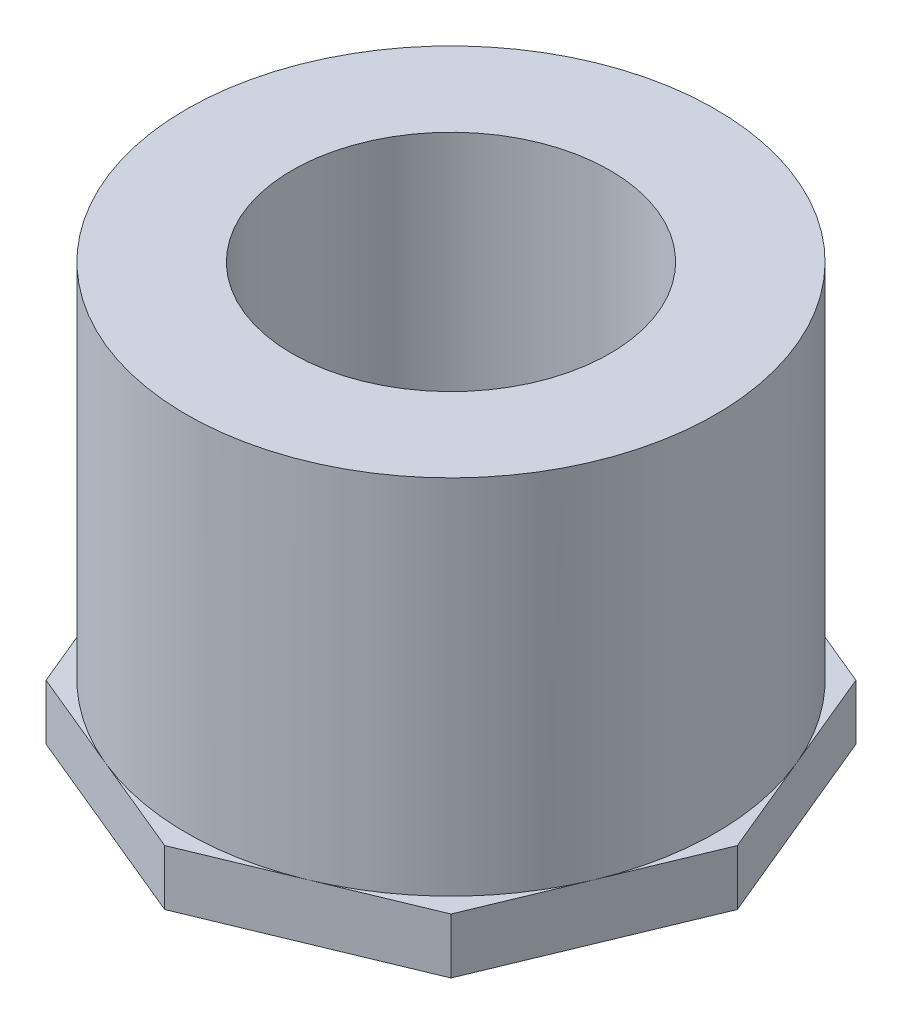
ISO-10303-21;
HEADER;
FILE_DESCRIPTION(('STEP AP214'),'2;1');
FILE_NAME('part.step','',(''),(''),'','','');
FILE_SCHEMA(('AUTOMOTIVE_DESIGN { 1 0 10303 214 1 1 1 1 }'));
ENDSEC;
DATA;
#1=APPLICATION_CONTEXT('core data for automotive mechanical design processes');
#2=APPLICATION_PROTOCOL_DEFINITION('international standard','automotive_design',2000,#1);
#3=PRODUCT_CONTEXT('',#1,'mechanical');
#4=PRODUCT('Part','Part','',(#3));
#5=PRODUCT_RELATED_PRODUCT_CATEGORY('part','',(#4));
#6=PRODUCT_DEFINITION_FORMATION('','',#4);
#7=PRODUCT_DEFINITION_CONTEXT('part definition',#1,'design');
#8=PRODUCT_DEFINITION('design','',#6,#7);
#9=PRODUCT_DEFINITION_SHAPE('','',#8);
#10=(LENGTH_UNIT() NAMED_UNIT(*) SI_UNIT(.MILLI.,.METRE.));
#11=(NAMED_UNIT(*) PLANE_ANGLE_UNIT() SI_UNIT($,.RADIAN.));
#12=(NAMED_UNIT(*) SI_UNIT($,.STERADIAN.) SOLID_ANGLE_UNIT());
#13=UNCERTAINTY_MEASURE_WITH_UNIT(LENGTH_MEASURE(1.E-05),#10,'distance_accuracy_value','');
#14=(GEOMETRIC_REPRESENTATION_CONTEXT(3) GLOBAL_UNCERTAINTY_ASSIGNED_CONTEXT((#13)) GLOBAL_UNIT_ASSIGNED_CONTEXT((#10,
#11,#12)) REPRESENTATION_CONTEXT('',''));
#15=CARTESIAN_POINT('',(0.,0.,0.));
#16=DIRECTION('',(0.,0.,1.));
#17=DIRECTION('',(1.,0.,0.));
#18=AXIS2_PLACEMENT_3D('',#15,#16,#17);
#19=CARTESIAN_POINT('',(0.,0.,0.));
#20=DIRECTION('',(0.,1.,0.));
#21=DIRECTION('',(-1.,0.,0.));
#22=AXIS2_PLACEMENT_3D('',#19,#20,#21);
#23=CYLINDRICAL_SURFACE('',#22,24.13);
#24=CARTESIAN_POINT('',(0.,38.1,0.));
#25=DIRECTION('',(0.,1.,0.));
#26=DIRECTION('',(-1.,0.,0.));
#27=AXIS2_PLACEMENT_3D('',#24,#25,#26);
#28=CIRCLE('',#27,24.13);
#29=CARTESIAN_POINT('',(-24.13,38.1,0.));
#30=VERTEX_POINT('',#29);
#31=EDGE_CURVE('E259',#30,#30,#28,.T.);
#32=ORIENTED_EDGE('',*,*,#31,.F.);
#33=EDGE_LOOP('',(#32));
#34=FACE_BOUND('',#33,.T.);
#35=CARTESIAN_POINT('',(0.,5.0546,0.));
#36=DIRECTION('',(0.,-1.,0.));
#37=DIRECTION('',(1.,0.,0.));
#38=AXIS2_PLACEMENT_3D('',#35,#36,#37);
#39=CIRCLE('',#38,24.13);
#40=CARTESIAN_POINT('',(22.2932131194974,5.0546,9.23415122296961));
#41=VERTEX_POINT('',#40);
#42=CARTESIAN_POINT('',(22.2932131194973,5.0546,-9.23415122296962));
#43=VERTEX_POINT('',#42);
#44=EDGE_CURVE('E53',#41,#43,#39,.F.);
#45=ORIENTED_EDGE('',*,*,#44,.T.);
#46=CARTESIAN_POINT('',(9.23415122296961,5.0546,-22.2932131194974));
#47=VERTEX_POINT('',#46);
#48=EDGE_CURVE('E11',#43,#47,#39,.F.);
#49=ORIENTED_EDGE('',*,*,#48,.T.);
#50=CARTESIAN_POINT('',(-9.23415122296962,5.0546,-22.2932131194973));
#51=VERTEX_POINT('',#50);
#52=EDGE_CURVE('E59',#47,#51,#39,.F.);
#53=ORIENTED_EDGE('',*,*,#52,.T.);
#54=CARTESIAN_POINT('',(-22.2932131194973,5.0546,-9.23415122296961));
#55=VERTEX_POINT('',#54);
#56=EDGE_CURVE('E299',#51,#55,#39,.F.);
#57=ORIENTED_EDGE('',*,*,#56,.T.);
#58=CARTESIAN_POINT('',(-22.2932131194973,5.0546,9.23415122296961));
#59=VERTEX_POINT('',#58);
#60=EDGE_CURVE('E296',#55,#59,#39,.F.);
#61=ORIENTED_EDGE('',*,*,#60,.T.);
#62=CARTESIAN_POINT('',(-9.23415122296961,5.0546,22.2932131194973));
#63=VERTEX_POINT('',#62);
#64=EDGE_CURVE('E294',#59,#63,#39,.F.);
#65=ORIENTED_EDGE('',*,*,#64,.T.);
#66=CARTESIAN_POINT('',(9.23415122296962,5.0546,22.2932131194973));
#67=VERTEX_POINT('',#66);
#68=EDGE_CURVE('E80',#63,#67,#39,.F.);
#69=ORIENTED_EDGE('',*,*,#68,.T.);
#70=EDGE_CURVE('E288',#67,#41,#39,.F.);
#71=ORIENTED_EDGE('',*,*,#70,.T.);
#72=EDGE_LOOP('',(#45,#49,#53,#57,#61,#65,#69,#71));
#73=FACE_BOUND('',#72,.T.);
#74=ADVANCED_FACE('F49',(#34,#73),#23,.T.);
#75=CARTESIAN_POINT('',(-24.13,0.,0.));
#76=DIRECTION('',(0.,-1.,0.));
#77=DIRECTION('',(1.,0.,0.));
#78=AXIS2_PLACEMENT_3D('',#75,#76,#77);
#79=PLANE('',#78);
#80=CARTESIAN_POINT('',(0.,0.,0.));
#81=DIRECTION('',(0.,-1.,0.));
#82=DIRECTION('',(0.,0.,-1.));
#83=AXIS2_PLACEMENT_3D('',#80,#81,#82);
#84=CIRCLE('',#83,15.730601);
#85=CARTESIAN_POINT('',(0.,0.,-15.730601));
#86=VERTEX_POINT('',#85);
#87=EDGE_CURVE('E367',#86,#86,#84,.T.);
#88=ORIENTED_EDGE('',*,*,#87,.F.);
#89=EDGE_LOOP('',(#88));
#90=FACE_BOUND('',#89,.T.);
#91=DIRECTION('',(-0.923879532511287,0.,0.38268343236509));
#92=VECTOR('',#91,1.);
#93=CARTESIAN_POINT('',(18.4683024459393,0.,18.4683024459392));
#94=LINE('',#93,#92);
#95=CARTESIAN_POINT('',(18.4683024459393,0.,18.4683024459392));
#96=VERTEX_POINT('',#95);
#97=CARTESIAN_POINT('',(0.,0.,26.1181237930555));
#98=VERTEX_POINT('',#97);
#99=EDGE_CURVE('E227',#96,#98,#94,.T.);
#100=ORIENTED_EDGE('',*,*,#99,.T.);
#101=DIRECTION('',(-0.923879532511287,0.,-0.382683432365089));
#102=VECTOR('',#101,1.);
#103=CARTESIAN_POINT('',(0.,0.,26.1181237930555));
#104=LINE('',#103,#102);
#105=CARTESIAN_POINT('',(-18.4683024459392,0.,18.4683024459392));
#106=VERTEX_POINT('',#105);
#107=EDGE_CURVE('E184',#98,#106,#104,.T.);
#108=ORIENTED_EDGE('',*,*,#107,.T.);
#109=DIRECTION('',(-0.38268343236509,0.,-0.923879532511287));
#110=VECTOR('',#109,1.);
#111=CARTESIAN_POINT('',(-18.4683024459392,0.,18.4683024459392));
#112=LINE('',#111,#110);
#113=CARTESIAN_POINT('',(-26.1181237930555,0.,0.));
#114=VERTEX_POINT('',#113);
#115=EDGE_CURVE('E233',#106,#114,#112,.T.);
#116=ORIENTED_EDGE('',*,*,#115,.T.);
#117=DIRECTION('',(0.38268343236509,0.,-0.923879532511287));
#118=VECTOR('',#117,1.);
#119=CARTESIAN_POINT('',(-26.1181237930555,0.,0.));
#120=LINE('',#119,#118);
#121=CARTESIAN_POINT('',(-18.4683024459392,0.,-18.4683024459392));
#122=VERTEX_POINT('',#121);
#123=EDGE_CURVE('E237',#114,#122,#120,.T.);
#124=ORIENTED_EDGE('',*,*,#123,.T.);
#125=DIRECTION('',(0.923879532511287,0.,-0.38268343236509));
#126=VECTOR('',#125,1.);
#127=CARTESIAN_POINT('',(-18.4683024459392,0.,-18.4683024459392));
#128=LINE('',#127,#126);
#129=CARTESIAN_POINT('',(0.,0.,-26.1181237930555));
#130=VERTEX_POINT('',#129);
#131=EDGE_CURVE('E241',#122,#130,#128,.T.);
#132=ORIENTED_EDGE('',*,*,#131,.T.);
#133=DIRECTION('',(0.923879532511287,0.,0.38268343236509));
#134=VECTOR('',#133,1.);
#135=CARTESIAN_POINT('',(0.,0.,-26.1181237930555));
#136=LINE('',#135,#134);
#137=CARTESIAN_POINT('',(18.4683024459392,0.,-18.4683024459392));
#138=VERTEX_POINT('',#137);
#139=EDGE_CURVE('E245',#130,#138,#136,.T.);
#140=ORIENTED_EDGE('',*,*,#139,.T.);
#141=DIRECTION('',(0.38268343236509,0.,0.923879532511287));
#142=VECTOR('',#141,1.);
#143=CARTESIAN_POINT('',(18.4683024459392,0.,-18.4683024459392));
#144=LINE('',#143,#142);
#145=CARTESIAN_POINT('',(26.1181237930555,0.,0.));
#146=VERTEX_POINT('',#145);
#147=EDGE_CURVE('E248',#138,#146,#144,.T.);
#148=ORIENTED_EDGE('',*,*,#147,.T.);
#149=DIRECTION('',(-0.382683432365089,0.,0.923879532511287));
#150=VECTOR('',#149,1.);
#151=CARTESIAN_POINT('',(26.1181237930555,0.,0.));
#152=LINE('',#151,#150);
#153=EDGE_CURVE('E175',#146,#96,#152,.T.);
#154=ORIENTED_EDGE('',*,*,#153,.T.);
#155=EDGE_LOOP('',(#100,#108,#116,#124,#132,#140,#148,#154));
#156=FACE_BOUND('',#155,.T.);
#157=ADVANCED_FACE('F51',(#90,#156),#79,.T.);
#158=CARTESIAN_POINT('',(-6.35,38.1,0.));
#159=DIRECTION('',(0.,1.,0.));
#160=DIRECTION('',(-1.,0.,0.));
#161=AXIS2_PLACEMENT_3D('',#158,#159,#160);
#162=PLANE('',#161);
#163=CARTESIAN_POINT('',(0.,38.1,0.));
#164=DIRECTION('',(0.,-1.,0.));
#165=DIRECTION('',(0.,0.,-1.));
#166=AXIS2_PLACEMENT_3D('',#163,#164,#165);
#167=CIRCLE('',#166,14.4907);
#168=CARTESIAN_POINT('',(0.,38.1,-14.4907));
#169=VERTEX_POINT('',#168);
#170=EDGE_CURVE('E230',#169,#169,#167,.T.);
#171=ORIENTED_EDGE('',*,*,#170,.T.);
#172=EDGE_LOOP('',(#171));
#173=FACE_BOUND('',#172,.T.);
#174=ORIENTED_EDGE('',*,*,#31,.T.);
#175=EDGE_LOOP('',(#174));
#176=FACE_BOUND('',#175,.T.);
#177=ADVANCED_FACE('F347',(#173,#176),#162,.T.);
#178=CARTESIAN_POINT('',(18.4683024459393,5.0546,18.4683024459392));
#179=DIRECTION('',(0.38268343236509,0.,0.923879532511287));
#180=DIRECTION('',(0.923879532511287,0.,-0.38268343236509));
#181=AXIS2_PLACEMENT_3D('',#178,#179,#180);
#182=PLANE('',#181);
#183=ORIENTED_EDGE('',*,*,#99,.F.);
#184=DIRECTION('',(0.,-1.,0.));
#185=VECTOR('',#184,1.);
#186=CARTESIAN_POINT('',(18.4683024459393,5.0546,18.4683024459392));
#187=LINE('',#186,#185);
#188=CARTESIAN_POINT('',(18.4683024459393,5.0546,18.4683024459392));
#189=VERTEX_POINT('',#188);
#190=EDGE_CURVE('E255',#189,#96,#187,.T.);
#191=ORIENTED_EDGE('',*,*,#190,.F.);
#192=DIRECTION('',(-0.923879532511287,0.,0.38268343236509));
#193=VECTOR('',#192,1.);
#194=CARTESIAN_POINT('',(18.4683024459393,5.0546,18.4683024459392));
#195=LINE('',#194,#193);
#196=EDGE_CURVE('E173',#189,#67,#195,.T.);
#197=ORIENTED_EDGE('',*,*,#196,.T.);
#198=CARTESIAN_POINT('',(0.,5.0546,26.1181237930555));
#199=VERTEX_POINT('',#198);
#200=EDGE_CURVE('E167',#67,#199,#195,.T.);
#201=ORIENTED_EDGE('',*,*,#200,.T.);
#202=DIRECTION('',(0.,-1.,0.));
#203=VECTOR('',#202,1.);
#204=CARTESIAN_POINT('',(0.,5.0546,26.1181237930555));
#205=LINE('',#204,#203);
#206=EDGE_CURVE('E170',#199,#98,#205,.T.);
#207=ORIENTED_EDGE('',*,*,#206,.T.);
#208=EDGE_LOOP('',(#183,#191,#197,#201,#207));
#209=FACE_BOUND('',#208,.T.);
#210=ADVANCED_FACE('F169',(#209),#182,.T.);
#211=CARTESIAN_POINT('',(26.1181237930555,5.0546,0.));
#212=DIRECTION('',(0.923879532511287,0.,0.38268343236509));
#213=DIRECTION('',(0.38268343236509,0.,-0.923879532511287));
#214=AXIS2_PLACEMENT_3D('',#211,#212,#213);
#215=PLANE('',#214);
#216=ORIENTED_EDGE('',*,*,#153,.F.);
#217=DIRECTION('',(0.,-1.,0.));
#218=VECTOR('',#217,1.);
#219=CARTESIAN_POINT('',(26.1181237930555,5.0546,0.));
#220=LINE('',#219,#218);
#221=CARTESIAN_POINT('',(26.1181237930555,5.0546,0.));
#222=VERTEX_POINT('',#221);
#223=EDGE_CURVE('E260',#222,#146,#220,.T.);
#224=ORIENTED_EDGE('',*,*,#223,.F.);
#225=DIRECTION('',(-0.382683432365089,0.,0.923879532511287));
#226=VECTOR('',#225,1.);
#227=CARTESIAN_POINT('',(26.1181237930555,5.0546,0.));
#228=LINE('',#227,#226);
#229=EDGE_CURVE('E188',#222,#41,#228,.T.);
#230=ORIENTED_EDGE('',*,*,#229,.T.);
#231=EDGE_CURVE('E223',#41,#189,#228,.T.);
#232=ORIENTED_EDGE('',*,*,#231,.T.);
#233=ORIENTED_EDGE('',*,*,#190,.T.);
#234=EDGE_LOOP('',(#216,#224,#230,#232,#233));
#235=FACE_BOUND('',#234,.T.);
#236=ADVANCED_FACE('F356',(#235),#215,.T.);
#237=CARTESIAN_POINT('',(18.4683024459392,5.0546,-18.4683024459392));
#238=DIRECTION('',(0.923879532511287,0.,-0.38268343236509));
#239=DIRECTION('',(-0.38268343236509,0.,-0.923879532511287));
#240=AXIS2_PLACEMENT_3D('',#237,#238,#239);
#241=PLANE('',#240);
#242=ORIENTED_EDGE('',*,*,#223,.T.);
#243=ORIENTED_EDGE('',*,*,#147,.F.);
#244=DIRECTION('',(0.,-1.,0.));
#245=VECTOR('',#244,1.);
#246=CARTESIAN_POINT('',(18.4683024459392,5.0546,-18.4683024459392));
#247=LINE('',#246,#245);
#248=CARTESIAN_POINT('',(18.4683024459392,5.0546,-18.4683024459392));
#249=VERTEX_POINT('',#248);
#250=EDGE_CURVE('E264',#249,#138,#247,.T.);
#251=ORIENTED_EDGE('',*,*,#250,.F.);
#252=DIRECTION('',(0.38268343236509,0.,0.923879532511287));
#253=VECTOR('',#252,1.);
#254=CARTESIAN_POINT('',(18.4683024459392,5.0546,-18.4683024459392));
#255=LINE('',#254,#253);
#256=EDGE_CURVE('E69',#249,#43,#255,.T.);
#257=ORIENTED_EDGE('',*,*,#256,.T.);
#258=EDGE_CURVE('E220',#43,#222,#255,.T.);
#259=ORIENTED_EDGE('',*,*,#258,.T.);
#260=EDGE_LOOP('',(#242,#243,#251,#257,#259));
#261=FACE_BOUND('',#260,.T.);
#262=ADVANCED_FACE('F383',(#261),#241,.T.);
#263=CARTESIAN_POINT('',(0.,5.0546,-26.1181237930555));
#264=DIRECTION('',(0.382683432365089,0.,-0.923879532511287));
#265=DIRECTION('',(-0.923879532511287,0.,-0.38268343236509));
#266=AXIS2_PLACEMENT_3D('',#263,#264,#265);
#267=PLANE('',#266);
#268=ORIENTED_EDGE('',*,*,#139,.F.);
#269=DIRECTION('',(0.,-1.,0.));
#270=VECTOR('',#269,1.);
#271=CARTESIAN_POINT('',(0.,5.0546,-26.1181237930555));
#272=LINE('',#271,#270);
#273=CARTESIAN_POINT('',(0.,5.0546,-26.1181237930555));
#274=VERTEX_POINT('',#273);
#275=EDGE_CURVE('E268',#274,#130,#272,.T.);
#276=ORIENTED_EDGE('',*,*,#275,.F.);
#277=DIRECTION('',(0.923879532511287,0.,0.38268343236509));
#278=VECTOR('',#277,1.);
#279=CARTESIAN_POINT('',(0.,5.0546,-26.1181237930555));
#280=LINE('',#279,#278);
#281=EDGE_CURVE('E216',#274,#47,#280,.T.);
#282=ORIENTED_EDGE('',*,*,#281,.T.);
#283=EDGE_CURVE('E215',#47,#249,#280,.T.);
#284=ORIENTED_EDGE('',*,*,#283,.T.);
#285=ORIENTED_EDGE('',*,*,#250,.T.);
#286=EDGE_LOOP('',(#268,#276,#282,#284,#285));
#287=FACE_BOUND('',#286,.T.);
#288=ADVANCED_FACE('F316',(#287),#267,.T.);
#289=CARTESIAN_POINT('',(-18.4683024459392,5.0546,-18.4683024459392));
#290=DIRECTION('',(-0.38268343236509,0.,-0.923879532511287));
#291=DIRECTION('',(-0.923879532511287,0.,0.38268343236509));
#292=AXIS2_PLACEMENT_3D('',#289,#290,#291);
#293=PLANE('',#292);
#294=ORIENTED_EDGE('',*,*,#131,.F.);
#295=DIRECTION('',(0.,-1.,0.));
#296=VECTOR('',#295,1.);
#297=CARTESIAN_POINT('',(-18.4683024459392,5.0546,-18.4683024459392));
#298=LINE('',#297,#296);
#299=CARTESIAN_POINT('',(-18.4683024459392,5.0546,-18.4683024459392));
#300=VERTEX_POINT('',#299);
#301=EDGE_CURVE('E272',#300,#122,#298,.T.);
#302=ORIENTED_EDGE('',*,*,#301,.F.);
#303=DIRECTION('',(0.923879532511287,0.,-0.38268343236509));
#304=VECTOR('',#303,1.);
#305=CARTESIAN_POINT('',(-18.4683024459392,5.0546,-18.4683024459392));
#306=LINE('',#305,#304);
#307=EDGE_CURVE('E211',#300,#51,#306,.T.);
#308=ORIENTED_EDGE('',*,*,#307,.T.);
#309=EDGE_CURVE('E210',#51,#274,#306,.T.);
#310=ORIENTED_EDGE('',*,*,#309,.T.);
#311=ORIENTED_EDGE('',*,*,#275,.T.);
#312=EDGE_LOOP('',(#294,#302,#308,#310,#311));
#313=FACE_BOUND('',#312,.T.);
#314=ADVANCED_FACE('F318',(#313),#293,.T.);
#315=CARTESIAN_POINT('',(-26.1181237930555,5.0546,0.));
#316=DIRECTION('',(-0.923879532511287,0.,-0.38268343236509));
#317=DIRECTION('',(-0.38268343236509,0.,0.923879532511287));
#318=AXIS2_PLACEMENT_3D('',#315,#316,#317);
#319=PLANE('',#318);
#320=ORIENTED_EDGE('',*,*,#123,.F.);
#321=DIRECTION('',(0.,-1.,0.));
#322=VECTOR('',#321,1.);
#323=CARTESIAN_POINT('',(-26.1181237930555,5.0546,0.));
#324=LINE('',#323,#322);
#325=CARTESIAN_POINT('',(-26.1181237930555,5.0546,0.));
#326=VERTEX_POINT('',#325);
#327=EDGE_CURVE('E276',#326,#114,#324,.T.);
#328=ORIENTED_EDGE('',*,*,#327,.F.);
#329=DIRECTION('',(0.38268343236509,0.,-0.923879532511287));
#330=VECTOR('',#329,1.);
#331=CARTESIAN_POINT('',(-26.1181237930555,5.0546,0.));
#332=LINE('',#331,#330);
#333=EDGE_CURVE('E206',#326,#55,#332,.T.);
#334=ORIENTED_EDGE('',*,*,#333,.T.);
#335=EDGE_CURVE('E205',#55,#300,#332,.T.);
#336=ORIENTED_EDGE('',*,*,#335,.T.);
#337=ORIENTED_EDGE('',*,*,#301,.T.);
#338=EDGE_LOOP('',(#320,#328,#334,#336,#337));
#339=FACE_BOUND('',#338,.T.);
#340=ADVANCED_FACE('F324',(#339),#319,.T.);
#341=CARTESIAN_POINT('',(-18.4683024459392,5.0546,18.4683024459392));
#342=DIRECTION('',(-0.923879532511287,0.,0.38268343236509));
#343=DIRECTION('',(0.38268343236509,0.,0.923879532511287));
#344=AXIS2_PLACEMENT_3D('',#341,#342,#343);
#345=PLANE('',#344);
#346=ORIENTED_EDGE('',*,*,#115,.F.);
#347=DIRECTION('',(0.,-1.,0.));
#348=VECTOR('',#347,1.);
#349=CARTESIAN_POINT('',(-18.4683024459392,5.0546,18.4683024459392));
#350=LINE('',#349,#348);
#351=CARTESIAN_POINT('',(-18.4683024459392,5.0546,18.4683024459392));
#352=VERTEX_POINT('',#351);
#353=EDGE_CURVE('E187',#352,#106,#350,.T.);
#354=ORIENTED_EDGE('',*,*,#353,.F.);
#355=DIRECTION('',(-0.38268343236509,0.,-0.923879532511287));
#356=VECTOR('',#355,1.);
#357=CARTESIAN_POINT('',(-18.4683024459392,5.0546,18.4683024459392));
#358=LINE('',#357,#356);
#359=EDGE_CURVE('E198',#352,#59,#358,.T.);
#360=ORIENTED_EDGE('',*,*,#359,.T.);
#361=EDGE_CURVE('E192',#59,#326,#358,.T.);
#362=ORIENTED_EDGE('',*,*,#361,.T.);
#363=ORIENTED_EDGE('',*,*,#327,.T.);
#364=EDGE_LOOP('',(#346,#354,#360,#362,#363));
#365=FACE_BOUND('',#364,.T.);
#366=ADVANCED_FACE('F389',(#365),#345,.T.);
#367=CARTESIAN_POINT('',(0.,5.0546,26.1181237930555));
#368=DIRECTION('',(-0.382683432365089,0.,0.923879532511287));
#369=DIRECTION('',(0.923879532511287,0.,0.38268343236509));
#370=AXIS2_PLACEMENT_3D('',#367,#368,#369);
#371=PLANE('',#370);
#372=ORIENTED_EDGE('',*,*,#107,.F.);
#373=ORIENTED_EDGE('',*,*,#206,.F.);
#374=DIRECTION('',(-0.923879532511287,0.,-0.382683432365089));
#375=VECTOR('',#374,1.);
#376=CARTESIAN_POINT('',(0.,5.0546,26.1181237930555));
#377=LINE('',#376,#375);
#378=EDGE_CURVE('E180',#199,#63,#377,.T.);
#379=ORIENTED_EDGE('',*,*,#378,.T.);
#380=EDGE_CURVE('E193',#63,#352,#377,.T.);
#381=ORIENTED_EDGE('',*,*,#380,.T.);
#382=ORIENTED_EDGE('',*,*,#353,.T.);
#383=EDGE_LOOP('',(#372,#373,#379,#381,#382));
#384=FACE_BOUND('',#383,.T.);
#385=ADVANCED_FACE('F179',(#384),#371,.T.);
#386=CARTESIAN_POINT('',(0.,5.0546,0.));
#387=DIRECTION('',(0.,-1.,0.));
#388=DIRECTION('',(1.,0.,0.));
#389=AXIS2_PLACEMENT_3D('',#386,#387,#388);
#390=PLANE('',#389);
#391=ORIENTED_EDGE('',*,*,#48,.F.);
#392=ORIENTED_EDGE('',*,*,#256,.F.);
#393=ORIENTED_EDGE('',*,*,#283,.F.);
#394=EDGE_LOOP('',(#391,#392,#393));
#395=FACE_BOUND('',#394,.T.);
#396=ADVANCED_FACE('F312',(#395),#390,.F.);
#397=ORIENTED_EDGE('',*,*,#52,.F.);
#398=ORIENTED_EDGE('',*,*,#281,.F.);
#399=ORIENTED_EDGE('',*,*,#309,.F.);
#400=EDGE_LOOP('',(#397,#398,#399));
#401=FACE_BOUND('',#400,.T.);
#402=ADVANCED_FACE('F310',(#401),#390,.F.);
#403=ORIENTED_EDGE('',*,*,#56,.F.);
#404=ORIENTED_EDGE('',*,*,#307,.F.);
#405=ORIENTED_EDGE('',*,*,#335,.F.);
#406=EDGE_LOOP('',(#403,#404,#405));
#407=FACE_BOUND('',#406,.T.);
#408=ADVANCED_FACE('F328',(#407),#390,.F.);
#409=ORIENTED_EDGE('',*,*,#60,.F.);
#410=ORIENTED_EDGE('',*,*,#333,.F.);
#411=ORIENTED_EDGE('',*,*,#361,.F.);
#412=EDGE_LOOP('',(#409,#410,#411));
#413=FACE_BOUND('',#412,.T.);
#414=ADVANCED_FACE('F330',(#413),#390,.F.);
#415=ORIENTED_EDGE('',*,*,#64,.F.);
#416=ORIENTED_EDGE('',*,*,#359,.F.);
#417=ORIENTED_EDGE('',*,*,#380,.F.);
#418=EDGE_LOOP('',(#415,#416,#417));
#419=FACE_BOUND('',#418,.T.);
#420=ADVANCED_FACE('F336',(#419),#390,.F.);
#421=ORIENTED_EDGE('',*,*,#68,.F.);
#422=ORIENTED_EDGE('',*,*,#378,.F.);
#423=ORIENTED_EDGE('',*,*,#200,.F.);
#424=EDGE_LOOP('',(#421,#422,#423));
#425=FACE_BOUND('',#424,.T.);
#426=ADVANCED_FACE('F190',(#425),#390,.F.);
#427=ORIENTED_EDGE('',*,*,#70,.F.);
#428=ORIENTED_EDGE('',*,*,#196,.F.);
#429=ORIENTED_EDGE('',*,*,#231,.F.);
#430=EDGE_LOOP('',(#427,#428,#429));
#431=FACE_BOUND('',#430,.T.);
#432=ADVANCED_FACE('F377',(#431),#390,.F.);
#433=ORIENTED_EDGE('',*,*,#44,.F.);
#434=ORIENTED_EDGE('',*,*,#229,.F.);
#435=ORIENTED_EDGE('',*,*,#258,.F.);
#436=EDGE_LOOP('',(#433,#434,#435));
#437=FACE_BOUND('',#436,.T.);
#438=ADVANCED_FACE('F338',(#437),#390,.F.);
#439=CARTESIAN_POINT('',(0.,0.,0.));
#440=DIRECTION('',(0.,-1.,0.));
#441=DIRECTION('',(0.,0.,-1.));
#442=AXIS2_PLACEMENT_3D('',#439,#440,#441);
#443=CYLINDRICAL_SURFACE('',#442,14.4907);
#444=ORIENTED_EDGE('',*,*,#170,.F.);
#445=EDGE_LOOP('',(#444));
#446=FACE_BOUND('',#445,.T.);
#447=CARTESIAN_POINT('',(0.,16.78686,0.));
#448=DIRECTION('',(0.,-1.,0.));
#449=DIRECTION('',(0.,0.,-1.));
#450=AXIS2_PLACEMENT_3D('',#447,#448,#449);
#451=CIRCLE('',#450,14.4907);
#452=CARTESIAN_POINT('',(0.,16.78686,-14.4907));
#453=VERTEX_POINT('',#452);
#454=EDGE_CURVE('E360',#453,#453,#451,.T.);
#455=ORIENTED_EDGE('',*,*,#454,.T.);
#456=EDGE_LOOP('',(#455));
#457=FACE_BOUND('',#456,.T.);
#458=ADVANCED_FACE('F401',(#446,#457),#443,.F.);
#459=CARTESIAN_POINT('',(14.4907,16.78686,0.));
#460=DIRECTION('',(0.,1.,0.));
#461=DIRECTION('',(0.,0.,1.));
#462=AXIS2_PLACEMENT_3D('',#459,#460,#461);
#463=PLANE('',#462);
#464=ORIENTED_EDGE('',*,*,#454,.F.);
#465=EDGE_LOOP('',(#464));
#466=FACE_BOUND('',#465,.T.);
#467=CARTESIAN_POINT('',(0.,16.78686,0.));
#468=DIRECTION('',(0.,-1.,0.));
#469=DIRECTION('',(0.,0.,-1.));
#470=AXIS2_PLACEMENT_3D('',#467,#468,#469);
#471=CIRCLE('',#470,15.2279799311318);
#472=CARTESIAN_POINT('',(0.,16.78686,-15.2279799311318));
#473=VERTEX_POINT('',#472);
#474=EDGE_CURVE('E362',#473,#473,#471,.T.);
#475=ORIENTED_EDGE('',*,*,#474,.T.);
#476=EDGE_LOOP('',(#475));
#477=FACE_BOUND('',#476,.T.);
#478=ADVANCED_FACE('F405',(#466,#477),#463,.F.);
#479=CARTESIAN_POINT('',(0.,0.,0.));
#480=DIRECTION('',(0.,-1.,0.));
#481=DIRECTION('',(0.,0.,-1.));
#482=AXIS2_PLACEMENT_3D('',#479,#480,#481);
#483=CONICAL_SURFACE('',#482,15.730601,0.029932396671703);
#484=ORIENTED_EDGE('',*,*,#474,.F.);
#485=EDGE_LOOP('',(#484));
#486=FACE_BOUND('',#485,.T.);
#487=ORIENTED_EDGE('',*,*,#87,.T.);
#488=EDGE_LOOP('',(#487));
#489=FACE_BOUND('',#488,.T.);
#490=ADVANCED_FACE('F372',(#486,#489),#483,.F.);
#491=CLOSED_SHELL('',(#74,#157,#177,#210,#236,#262,#288,#314,#340,#366,#385,#396,#402,#408,#414,
#420,#426,#432,#438,#458,#478,#490));
#492=MANIFOLD_SOLID_BREP('B2',#491);
#493=ADVANCED_BREP_SHAPE_REPRESENTATION('',(#18,#492),#14);
#494=SHAPE_DEFINITION_REPRESENTATION(#9,#493);
ENDSEC;
END-ISO-10303-21;
